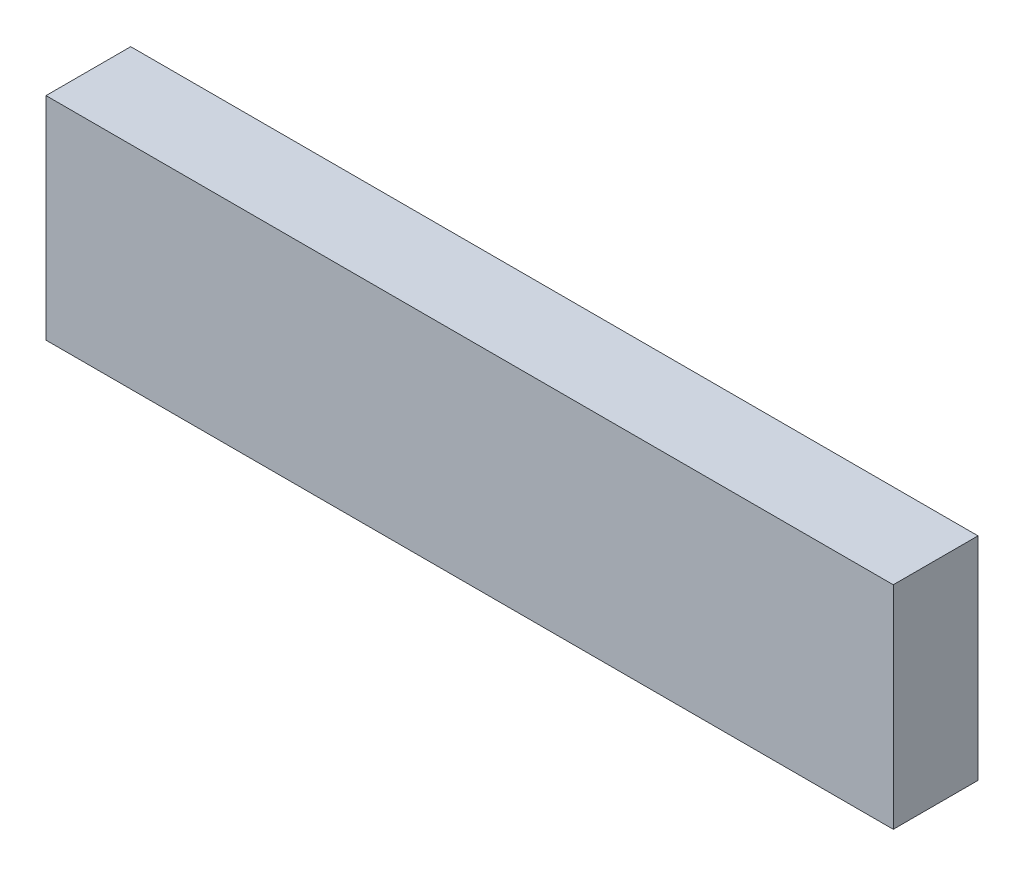
ISO-10303-21;
HEADER;
FILE_DESCRIPTION(('STEP AP214'),'2;1');
FILE_NAME('part.step','',(''),(''),'','','');
FILE_SCHEMA(('AUTOMOTIVE_DESIGN { 1 0 10303 214 1 1 1 1 }'));
ENDSEC;
DATA;
#1=APPLICATION_CONTEXT('core data for automotive mechanical design processes');
#2=APPLICATION_PROTOCOL_DEFINITION('international standard','automotive_design',2000,#1);
#3=PRODUCT_CONTEXT('',#1,'mechanical');
#4=PRODUCT('Part','Part','',(#3));
#5=PRODUCT_RELATED_PRODUCT_CATEGORY('part','',(#4));
#6=PRODUCT_DEFINITION_FORMATION('','',#4);
#7=PRODUCT_DEFINITION_CONTEXT('part definition',#1,'design');
#8=PRODUCT_DEFINITION('design','',#6,#7);
#9=PRODUCT_DEFINITION_SHAPE('','',#8);
#10=(LENGTH_UNIT() NAMED_UNIT(*) SI_UNIT(.MILLI.,.METRE.));
#11=(NAMED_UNIT(*) PLANE_ANGLE_UNIT() SI_UNIT($,.RADIAN.));
#12=(NAMED_UNIT(*) SI_UNIT($,.STERADIAN.) SOLID_ANGLE_UNIT());
#13=UNCERTAINTY_MEASURE_WITH_UNIT(LENGTH_MEASURE(1.E-05),#10,'distance_accuracy_value','');
#14=(GEOMETRIC_REPRESENTATION_CONTEXT(3) GLOBAL_UNCERTAINTY_ASSIGNED_CONTEXT((#13)) GLOBAL_UNIT_ASSIGNED_CONTEXT((#10,
#11,#12)) REPRESENTATION_CONTEXT('',''));
#15=CARTESIAN_POINT('',(0.,0.,0.));
#16=DIRECTION('',(0.,0.,1.));
#17=DIRECTION('',(1.,0.,0.));
#18=AXIS2_PLACEMENT_3D('',#15,#16,#17);
#19=CARTESIAN_POINT('',(-5.99999999999999,46.99,55.8));
#20=DIRECTION('',(0.,0.,-1.));
#21=DIRECTION('',(-1.,0.,0.));
#22=AXIS2_PLACEMENT_3D('',#19,#20,#21);
#23=PLANE('',#22);
#24=DIRECTION('',(0.,1.,0.));
#25=VECTOR('',#24,1.);
#26=CARTESIAN_POINT('',(6.00000000000001,46.99,55.8));
#27=LINE('',#26,#25);
#28=CARTESIAN_POINT('',(6.00000000000006,47.,55.8));
#29=VERTEX_POINT('',#28);
#30=CARTESIAN_POINT('',(6.00000000000006,50.,55.8));
#31=VERTEX_POINT('',#30);
#32=EDGE_CURVE('E11',#29,#31,#27,.T.);
#33=ORIENTED_EDGE('',*,*,#32,.F.);
#34=DIRECTION('',(-1.,0.,0.));
#35=VECTOR('',#34,1.);
#36=CARTESIAN_POINT('',(300.,47.,55.8));
#37=LINE('',#36,#35);
#38=CARTESIAN_POINT('',(-6.00000000000001,47.,55.8));
#39=VERTEX_POINT('',#38);
#40=EDGE_CURVE('E39',#29,#39,#37,.T.);
#41=ORIENTED_EDGE('',*,*,#40,.T.);
#42=DIRECTION('',(0.,1.,0.));
#43=VECTOR('',#42,1.);
#44=CARTESIAN_POINT('',(-5.99999999999999,46.99,55.8));
#45=LINE('',#44,#43);
#46=CARTESIAN_POINT('',(-6.00000000000001,50.,55.8));
#47=VERTEX_POINT('',#46);
#48=EDGE_CURVE('E44',#39,#47,#45,.T.);
#49=ORIENTED_EDGE('',*,*,#48,.T.);
#50=DIRECTION('',(1.,0.,0.));
#51=VECTOR('',#50,1.);
#52=CARTESIAN_POINT('',(-300.,50.,55.8));
#53=LINE('',#52,#51);
#54=EDGE_CURVE('E94',#47,#31,#53,.T.);
#55=ORIENTED_EDGE('',*,*,#54,.T.);
#56=EDGE_LOOP('',(#33,#41,#49,#55));
#57=FACE_BOUND('',#56,.T.);
#58=ADVANCED_FACE('F35',(#57),#23,.T.);
#59=CARTESIAN_POINT('',(6.00000000000001,46.99,57.));
#60=DIRECTION('',(1.,0.,0.));
#61=DIRECTION('',(0.,0.,-1.));
#62=AXIS2_PLACEMENT_3D('',#59,#60,#61);
#63=PLANE('',#62);
#64=DIRECTION('',(0.,1.,0.));
#65=VECTOR('',#64,1.);
#66=CARTESIAN_POINT('',(6.00000000000001,46.99,57.));
#67=LINE('',#66,#65);
#68=CARTESIAN_POINT('',(6.00000000000001,47.,57.));
#69=VERTEX_POINT('',#68);
#70=CARTESIAN_POINT('',(6.00000000000001,50.,57.));
#71=VERTEX_POINT('',#70);
#72=EDGE_CURVE('E83',#69,#71,#67,.T.);
#73=ORIENTED_EDGE('',*,*,#72,.F.);
#74=DIRECTION('',(0.,0.,-1.));
#75=VECTOR('',#74,1.);
#76=CARTESIAN_POINT('',(6.00000000000001,47.,3.));
#77=LINE('',#76,#75);
#78=EDGE_CURVE('E102',#69,#29,#77,.T.);
#79=ORIENTED_EDGE('',*,*,#78,.T.);
#80=ORIENTED_EDGE('',*,*,#32,.T.);
#81=DIRECTION('',(0.,0.,1.));
#82=VECTOR('',#81,1.);
#83=CARTESIAN_POINT('',(6.00000000000001,50.,60.));
#84=LINE('',#83,#82);
#85=EDGE_CURVE('E91',#31,#71,#84,.T.);
#86=ORIENTED_EDGE('',*,*,#85,.T.);
#87=EDGE_LOOP('',(#73,#79,#80,#86));
#88=FACE_BOUND('',#87,.T.);
#89=ADVANCED_FACE('F114',(#88),#63,.T.);
#90=CARTESIAN_POINT('',(-5.99999999999999,46.99,57.));
#91=DIRECTION('',(-1.,0.,0.));
#92=DIRECTION('',(0.,0.,1.));
#93=AXIS2_PLACEMENT_3D('',#90,#91,#92);
#94=PLANE('',#93);
#95=ORIENTED_EDGE('',*,*,#48,.F.);
#96=DIRECTION('',(0.,0.,1.));
#97=VECTOR('',#96,1.);
#98=CARTESIAN_POINT('',(-6.00000000000001,47.,3.));
#99=LINE('',#98,#97);
#100=CARTESIAN_POINT('',(-6.00000000000001,47.,57.));
#101=VERTEX_POINT('',#100);
#102=EDGE_CURVE('E79',#39,#101,#99,.T.);
#103=ORIENTED_EDGE('',*,*,#102,.T.);
#104=DIRECTION('',(0.,1.,0.));
#105=VECTOR('',#104,1.);
#106=CARTESIAN_POINT('',(-5.99999999999999,46.99,57.));
#107=LINE('',#106,#105);
#108=CARTESIAN_POINT('',(-6.00000000000001,50.,57.));
#109=VERTEX_POINT('',#108);
#110=EDGE_CURVE('E73',#101,#109,#107,.T.);
#111=ORIENTED_EDGE('',*,*,#110,.T.);
#112=DIRECTION('',(0.,0.,-1.));
#113=VECTOR('',#112,1.);
#114=CARTESIAN_POINT('',(-6.00000000000001,50.,60.));
#115=LINE('',#114,#113);
#116=EDGE_CURVE('E77',#109,#47,#115,.T.);
#117=ORIENTED_EDGE('',*,*,#116,.T.);
#118=EDGE_LOOP('',(#95,#103,#111,#117));
#119=FACE_BOUND('',#118,.T.);
#120=ADVANCED_FACE('F75',(#119),#94,.T.);
#121=CARTESIAN_POINT('',(-5.99999999999999,46.99,57.));
#122=DIRECTION('',(0.,0.,1.));
#123=DIRECTION('',(1.,0.,0.));
#124=AXIS2_PLACEMENT_3D('',#121,#122,#123);
#125=PLANE('',#124);
#126=ORIENTED_EDGE('',*,*,#110,.F.);
#127=DIRECTION('',(1.,0.,0.));
#128=VECTOR('',#127,1.);
#129=CARTESIAN_POINT('',(300.,47.,57.));
#130=LINE('',#129,#128);
#131=EDGE_CURVE('E101',#101,#69,#130,.T.);
#132=ORIENTED_EDGE('',*,*,#131,.T.);
#133=ORIENTED_EDGE('',*,*,#72,.T.);
#134=DIRECTION('',(-1.,0.,0.));
#135=VECTOR('',#134,1.);
#136=CARTESIAN_POINT('',(-300.,50.,57.));
#137=LINE('',#136,#135);
#138=EDGE_CURVE('E86',#71,#109,#137,.T.);
#139=ORIENTED_EDGE('',*,*,#138,.T.);
#140=EDGE_LOOP('',(#126,#132,#133,#139));
#141=FACE_BOUND('',#140,.T.);
#142=ADVANCED_FACE('F87',(#141),#125,.T.);
#143=CARTESIAN_POINT('',(300.,47.,3.));
#144=DIRECTION('',(0.,1.,0.));
#145=DIRECTION('',(0.,0.,1.));
#146=AXIS2_PLACEMENT_3D('',#143,#144,#145);
#147=PLANE('',#146);
#148=ORIENTED_EDGE('',*,*,#102,.F.);
#149=ORIENTED_EDGE('',*,*,#40,.F.);
#150=ORIENTED_EDGE('',*,*,#78,.F.);
#151=ORIENTED_EDGE('',*,*,#131,.F.);
#152=EDGE_LOOP('',(#148,#149,#150,#151));
#153=FACE_BOUND('',#152,.T.);
#154=ADVANCED_FACE('F107',(#153),#147,.F.);
#155=CARTESIAN_POINT('',(-300.,50.,60.));
#156=DIRECTION('',(0.,-1.,0.));
#157=DIRECTION('',(0.,0.,-1.));
#158=AXIS2_PLACEMENT_3D('',#155,#156,#157);
#159=PLANE('',#158);
#160=ORIENTED_EDGE('',*,*,#116,.F.);
#161=ORIENTED_EDGE('',*,*,#138,.F.);
#162=ORIENTED_EDGE('',*,*,#85,.F.);
#163=ORIENTED_EDGE('',*,*,#54,.F.);
#164=EDGE_LOOP('',(#160,#161,#162,#163));
#165=FACE_BOUND('',#164,.T.);
#166=ADVANCED_FACE('F37',(#165),#159,.F.);
#167=CLOSED_SHELL('',(#58,#89,#120,#142,#154,#166));
#168=MANIFOLD_SOLID_BREP('B2',#167);
#169=ADVANCED_BREP_SHAPE_REPRESENTATION('',(#18,#168),#14);
#170=SHAPE_DEFINITION_REPRESENTATION(#9,#169);
ENDSEC;
END-ISO-10303-21;
